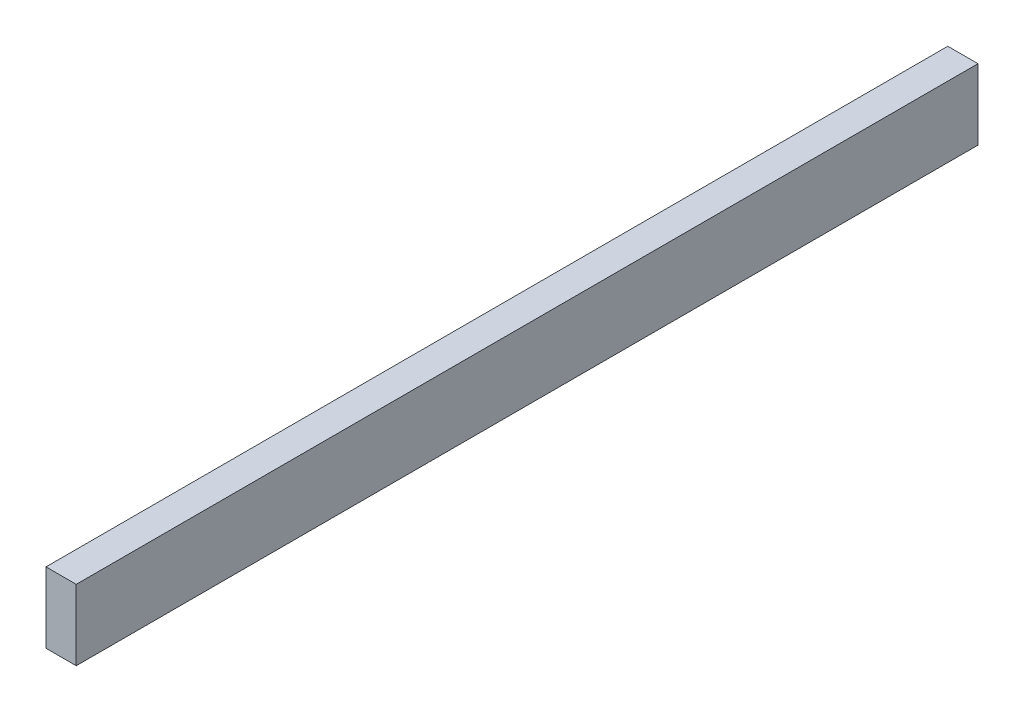
ISO-10303-21;
HEADER;
FILE_DESCRIPTION(('STEP AP214'),'2;1');
FILE_NAME('part.step','',(''),(''),'','','');
FILE_SCHEMA(('AUTOMOTIVE_DESIGN { 1 0 10303 214 1 1 1 1 }'));
ENDSEC;
DATA;
#1=APPLICATION_CONTEXT('core data for automotive mechanical design processes');
#2=APPLICATION_PROTOCOL_DEFINITION('international standard','automotive_design',2000,#1);
#3=PRODUCT_CONTEXT('',#1,'mechanical');
#4=PRODUCT('Part','Part','',(#3));
#5=PRODUCT_RELATED_PRODUCT_CATEGORY('part','',(#4));
#6=PRODUCT_DEFINITION_FORMATION('','',#4);
#7=PRODUCT_DEFINITION_CONTEXT('part definition',#1,'design');
#8=PRODUCT_DEFINITION('design','',#6,#7);
#9=PRODUCT_DEFINITION_SHAPE('','',#8);
#10=(LENGTH_UNIT() NAMED_UNIT(*) SI_UNIT(.MILLI.,.METRE.));
#11=(NAMED_UNIT(*) PLANE_ANGLE_UNIT() SI_UNIT($,.RADIAN.));
#12=(NAMED_UNIT(*) SI_UNIT($,.STERADIAN.) SOLID_ANGLE_UNIT());
#13=UNCERTAINTY_MEASURE_WITH_UNIT(LENGTH_MEASURE(1.E-05),#10,'distance_accuracy_value','');
#14=(GEOMETRIC_REPRESENTATION_CONTEXT(3) GLOBAL_UNCERTAINTY_ASSIGNED_CONTEXT((#13)) GLOBAL_UNIT_ASSIGNED_CONTEXT((#10,
#11,#12)) REPRESENTATION_CONTEXT('',''));
#15=CARTESIAN_POINT('',(0.,0.,0.));
#16=DIRECTION('',(0.,0.,1.));
#17=DIRECTION('',(1.,0.,0.));
#18=AXIS2_PLACEMENT_3D('',#15,#16,#17);
#19=CARTESIAN_POINT('',(-38.1,57.3853647338962,1136.65));
#20=DIRECTION('',(1.,0.,0.));
#21=DIRECTION('',(0.,1.,0.));
#22=AXIS2_PLACEMENT_3D('',#19,#20,#21);
#23=PLANE('',#22);
#24=DIRECTION('',(0.,-1.,0.));
#25=VECTOR('',#24,1.);
#26=CARTESIAN_POINT('',(-38.1,57.3853647338962,0.));
#27=LINE('',#26,#25);
#28=CARTESIAN_POINT('',(-38.1,57.3853647338962,0.));
#29=VERTEX_POINT('',#28);
#30=CARTESIAN_POINT('',(-38.1,-31.5146352661038,0.));
#31=VERTEX_POINT('',#30);
#32=EDGE_CURVE('E95',#29,#31,#27,.T.);
#33=ORIENTED_EDGE('',*,*,#32,.T.);
#34=DIRECTION('',(0.,0.,-1.));
#35=VECTOR('',#34,1.);
#36=CARTESIAN_POINT('',(-38.1,-31.5146352661038,1136.65));
#37=LINE('',#36,#35);
#38=CARTESIAN_POINT('',(-38.1,-31.5146352661038,1136.65));
#39=VERTEX_POINT('',#38);
#40=EDGE_CURVE('E11',#39,#31,#37,.T.);
#41=ORIENTED_EDGE('',*,*,#40,.F.);
#42=DIRECTION('',(0.,-1.,0.));
#43=VECTOR('',#42,1.);
#44=CARTESIAN_POINT('',(-38.1,57.3853647338962,1136.65));
#45=LINE('',#44,#43);
#46=CARTESIAN_POINT('',(-38.1,57.3853647338962,1136.65));
#47=VERTEX_POINT('',#46);
#48=EDGE_CURVE('E83',#47,#39,#45,.T.);
#49=ORIENTED_EDGE('',*,*,#48,.F.);
#50=DIRECTION('',(0.,0.,-1.));
#51=VECTOR('',#50,1.);
#52=CARTESIAN_POINT('',(-38.1,57.3853647338962,1136.65));
#53=LINE('',#52,#51);
#54=EDGE_CURVE('E91',#47,#29,#53,.T.);
#55=ORIENTED_EDGE('',*,*,#54,.T.);
#56=EDGE_LOOP('',(#33,#41,#49,#55));
#57=FACE_BOUND('',#56,.T.);
#58=ADVANCED_FACE('F32',(#57),#23,.F.);
#59=CARTESIAN_POINT('',(-38.1,-31.5146352661038,1136.65));
#60=DIRECTION('',(0.,1.,0.));
#61=DIRECTION('',(0.,0.,1.));
#62=AXIS2_PLACEMENT_3D('',#59,#60,#61);
#63=PLANE('',#62);
#64=DIRECTION('',(1.,0.,0.));
#65=VECTOR('',#64,1.);
#66=CARTESIAN_POINT('',(-38.1,-31.5146352661038,0.));
#67=LINE('',#66,#65);
#68=CARTESIAN_POINT('',(0.,-31.5146352661038,0.));
#69=VERTEX_POINT('',#68);
#70=EDGE_CURVE('E87',#31,#69,#67,.T.);
#71=ORIENTED_EDGE('',*,*,#70,.T.);
#72=DIRECTION('',(0.,0.,-1.));
#73=VECTOR('',#72,1.);
#74=CARTESIAN_POINT('',(0.,-31.5146352661038,1136.65));
#75=LINE('',#74,#73);
#76=CARTESIAN_POINT('',(0.,-31.5146352661038,1136.65));
#77=VERTEX_POINT('',#76);
#78=EDGE_CURVE('E40',#77,#69,#75,.T.);
#79=ORIENTED_EDGE('',*,*,#78,.F.);
#80=DIRECTION('',(1.,0.,0.));
#81=VECTOR('',#80,1.);
#82=CARTESIAN_POINT('',(-38.1,-31.5146352661038,1136.65));
#83=LINE('',#82,#81);
#84=EDGE_CURVE('E78',#39,#77,#83,.T.);
#85=ORIENTED_EDGE('',*,*,#84,.F.);
#86=ORIENTED_EDGE('',*,*,#40,.T.);
#87=EDGE_LOOP('',(#71,#79,#85,#86));
#88=FACE_BOUND('',#87,.T.);
#89=ADVANCED_FACE('F86',(#88),#63,.F.);
#90=CARTESIAN_POINT('',(0.,57.3853647338962,1136.65));
#91=DIRECTION('',(-1.,0.,0.));
#92=DIRECTION('',(0.,-1.,0.));
#93=AXIS2_PLACEMENT_3D('',#90,#91,#92);
#94=PLANE('',#93);
#95=DIRECTION('',(0.,1.,0.));
#96=VECTOR('',#95,1.);
#97=CARTESIAN_POINT('',(0.,57.3853647338962,0.));
#98=LINE('',#97,#96);
#99=CARTESIAN_POINT('',(0.,57.3853647338962,0.));
#100=VERTEX_POINT('',#99);
#101=EDGE_CURVE('E65',#69,#100,#98,.T.);
#102=ORIENTED_EDGE('',*,*,#101,.T.);
#103=DIRECTION('',(0.,0.,-1.));
#104=VECTOR('',#103,1.);
#105=CARTESIAN_POINT('',(0.,57.3853647338962,1136.65));
#106=LINE('',#105,#104);
#107=CARTESIAN_POINT('',(0.,57.3853647338962,1136.65));
#108=VERTEX_POINT('',#107);
#109=EDGE_CURVE('E88',#108,#100,#106,.T.);
#110=ORIENTED_EDGE('',*,*,#109,.F.);
#111=DIRECTION('',(0.,1.,0.));
#112=VECTOR('',#111,1.);
#113=CARTESIAN_POINT('',(0.,57.3853647338962,1136.65));
#114=LINE('',#113,#112);
#115=EDGE_CURVE('E81',#77,#108,#114,.T.);
#116=ORIENTED_EDGE('',*,*,#115,.F.);
#117=ORIENTED_EDGE('',*,*,#78,.T.);
#118=EDGE_LOOP('',(#102,#110,#116,#117));
#119=FACE_BOUND('',#118,.T.);
#120=ADVANCED_FACE('F89',(#119),#94,.F.);
#121=CARTESIAN_POINT('',(-38.1,57.3853647338962,1136.65));
#122=DIRECTION('',(0.,-1.,0.));
#123=DIRECTION('',(0.,0.,-1.));
#124=AXIS2_PLACEMENT_3D('',#121,#122,#123);
#125=PLANE('',#124);
#126=DIRECTION('',(-1.,0.,0.));
#127=VECTOR('',#126,1.);
#128=CARTESIAN_POINT('',(-38.1,57.3853647338962,0.));
#129=LINE('',#128,#127);
#130=EDGE_CURVE('E71',#100,#29,#129,.T.);
#131=ORIENTED_EDGE('',*,*,#130,.T.);
#132=ORIENTED_EDGE('',*,*,#54,.F.);
#133=DIRECTION('',(-1.,0.,0.));
#134=VECTOR('',#133,1.);
#135=CARTESIAN_POINT('',(-38.1,57.3853647338962,1136.65));
#136=LINE('',#135,#134);
#137=EDGE_CURVE('E48',#108,#47,#136,.T.);
#138=ORIENTED_EDGE('',*,*,#137,.F.);
#139=ORIENTED_EDGE('',*,*,#109,.T.);
#140=EDGE_LOOP('',(#131,#132,#138,#139));
#141=FACE_BOUND('',#140,.T.);
#142=ADVANCED_FACE('F102',(#141),#125,.F.);
#143=CARTESIAN_POINT('',(0.,0.,1136.65));
#144=DIRECTION('',(0.,0.,1.));
#145=DIRECTION('',(1.,0.,0.));
#146=AXIS2_PLACEMENT_3D('',#143,#144,#145);
#147=PLANE('',#146);
#148=ORIENTED_EDGE('',*,*,#48,.T.);
#149=ORIENTED_EDGE('',*,*,#84,.T.);
#150=ORIENTED_EDGE('',*,*,#115,.T.);
#151=ORIENTED_EDGE('',*,*,#137,.T.);
#152=EDGE_LOOP('',(#148,#149,#150,#151));
#153=FACE_BOUND('',#152,.T.);
#154=ADVANCED_FACE('F79',(#153),#147,.T.);
#155=CARTESIAN_POINT('',(0.,0.,0.));
#156=DIRECTION('',(0.,0.,1.));
#157=DIRECTION('',(1.,0.,0.));
#158=AXIS2_PLACEMENT_3D('',#155,#156,#157);
#159=PLANE('',#158);
#160=ORIENTED_EDGE('',*,*,#32,.F.);
#161=ORIENTED_EDGE('',*,*,#130,.F.);
#162=ORIENTED_EDGE('',*,*,#101,.F.);
#163=ORIENTED_EDGE('',*,*,#70,.F.);
#164=EDGE_LOOP('',(#160,#161,#162,#163));
#165=FACE_BOUND('',#164,.T.);
#166=ADVANCED_FACE('F105',(#165),#159,.F.);
#167=CLOSED_SHELL('',(#58,#89,#120,#142,#154,#166));
#168=MANIFOLD_SOLID_BREP('B2',#167);
#169=ADVANCED_BREP_SHAPE_REPRESENTATION('',(#18,#168),#14);
#170=SHAPE_DEFINITION_REPRESENTATION(#9,#169);
ENDSEC;
END-ISO-10303-21;
